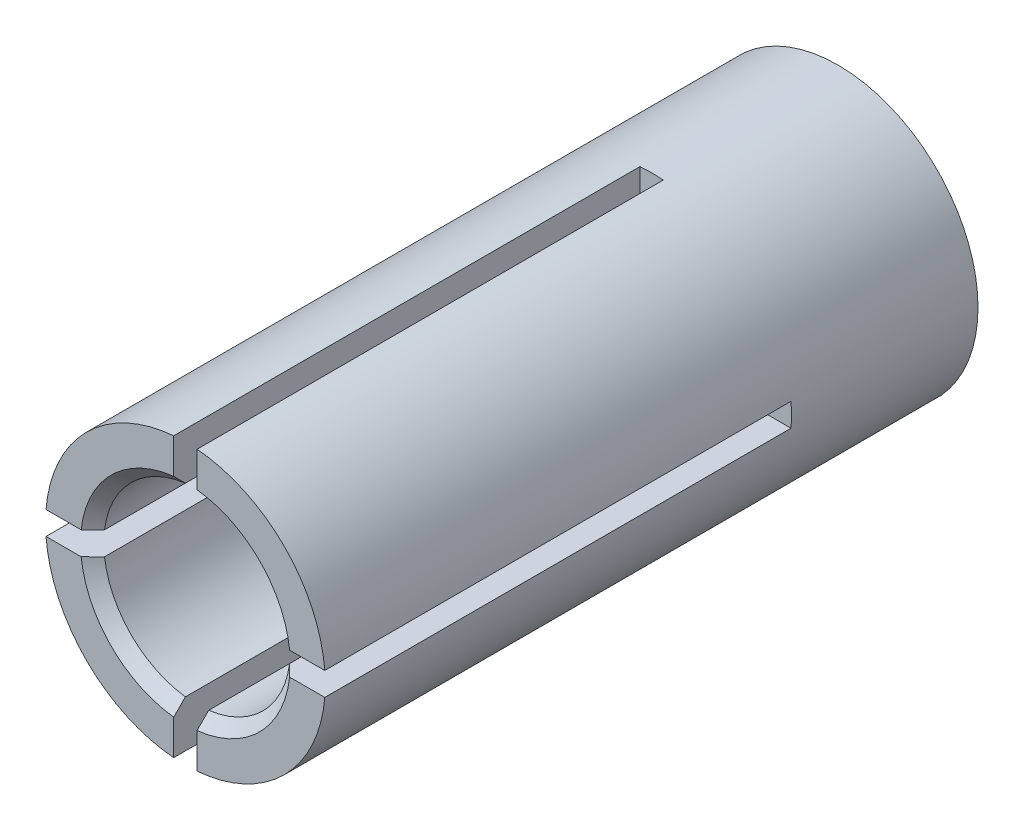
ISO-10303-21;
HEADER;
FILE_DESCRIPTION(('STEP AP214'),'2;1');
FILE_NAME('part.step','',(''),(''),'','','');
FILE_SCHEMA(('AUTOMOTIVE_DESIGN { 1 0 10303 214 1 1 1 1 }'));
ENDSEC;
DATA;
#1=APPLICATION_CONTEXT('core data for automotive mechanical design processes');
#2=APPLICATION_PROTOCOL_DEFINITION('international standard','automotive_design',2000,#1);
#3=PRODUCT_CONTEXT('',#1,'mechanical');
#4=PRODUCT('Part','Part','',(#3));
#5=PRODUCT_RELATED_PRODUCT_CATEGORY('part','',(#4));
#6=PRODUCT_DEFINITION_FORMATION('','',#4);
#7=PRODUCT_DEFINITION_CONTEXT('part definition',#1,'design');
#8=PRODUCT_DEFINITION('design','',#6,#7);
#9=PRODUCT_DEFINITION_SHAPE('','',#8);
#10=(LENGTH_UNIT() NAMED_UNIT(*) SI_UNIT(.MILLI.,.METRE.));
#11=(NAMED_UNIT(*) PLANE_ANGLE_UNIT() SI_UNIT($,.RADIAN.));
#12=(NAMED_UNIT(*) SI_UNIT($,.STERADIAN.) SOLID_ANGLE_UNIT());
#13=UNCERTAINTY_MEASURE_WITH_UNIT(LENGTH_MEASURE(1.E-05),#10,'distance_accuracy_value','');
#14=(GEOMETRIC_REPRESENTATION_CONTEXT(3) GLOBAL_UNCERTAINTY_ASSIGNED_CONTEXT((#13)) GLOBAL_UNIT_ASSIGNED_CONTEXT((#10,
#11,#12)) REPRESENTATION_CONTEXT('',''));
#15=CARTESIAN_POINT('',(0.,0.,0.));
#16=DIRECTION('',(0.,0.,1.));
#17=DIRECTION('',(1.,0.,0.));
#18=AXIS2_PLACEMENT_3D('',#15,#16,#17);
#19=CARTESIAN_POINT('',(0.,0.,14.));
#20=DIRECTION('',(0.,0.,1.));
#21=DIRECTION('',(1.,0.,0.));
#22=AXIS2_PLACEMENT_3D('',#19,#20,#21);
#23=PLANE('',#22);
#24=DIRECTION('',(1.,0.,0.));
#25=VECTOR('',#24,1.);
#26=CARTESIAN_POINT('',(2.98956518577535,-0.25,14.));
#27=LINE('',#26,#25);
#28=CARTESIAN_POINT('',(2.23606797749979,-0.25,14.));
#29=VERTEX_POINT('',#28);
#30=CARTESIAN_POINT('',(2.98956518577535,-0.25,14.));
#31=VERTEX_POINT('',#30);
#32=EDGE_CURVE('E190',#29,#31,#27,.T.);
#33=ORIENTED_EDGE('',*,*,#32,.F.);
#34=CARTESIAN_POINT('',(0.,0.,14.));
#35=DIRECTION('',(0.,0.,1.));
#36=DIRECTION('',(1.,0.,0.));
#37=AXIS2_PLACEMENT_3D('',#34,#35,#36);
#38=CIRCLE('',#37,2.25);
#39=CARTESIAN_POINT('',(0.25,-2.23606797749979,14.));
#40=VERTEX_POINT('',#39);
#41=EDGE_CURVE('E236',#29,#40,#38,.F.);
#42=ORIENTED_EDGE('',*,*,#41,.T.);
#43=DIRECTION('',(0.,1.,0.));
#44=VECTOR('',#43,1.);
#45=CARTESIAN_POINT('',(0.25,-0.25,14.));
#46=LINE('',#45,#44);
#47=CARTESIAN_POINT('',(0.250000000000002,-2.98956518577535,14.));
#48=VERTEX_POINT('',#47);
#49=EDGE_CURVE('E288',#48,#40,#46,.T.);
#50=ORIENTED_EDGE('',*,*,#49,.F.);
#51=CARTESIAN_POINT('',(0.,0.,14.));
#52=DIRECTION('',(0.,0.,1.));
#53=DIRECTION('',(1.,0.,0.));
#54=AXIS2_PLACEMENT_3D('',#51,#52,#53);
#55=CIRCLE('',#54,3.);
#56=EDGE_CURVE('E228',#48,#31,#55,.T.);
#57=ORIENTED_EDGE('',*,*,#56,.T.);
#58=EDGE_LOOP('',(#33,#42,#50,#57));
#59=FACE_BOUND('',#58,.T.);
#60=ADVANCED_FACE('F31',(#59),#23,.T.);
#61=DIRECTION('',(0.,-1.,0.));
#62=VECTOR('',#61,1.);
#63=CARTESIAN_POINT('',(-0.25,-0.25,14.));
#64=LINE('',#63,#62);
#65=CARTESIAN_POINT('',(-0.25,-2.23606797749979,14.));
#66=VERTEX_POINT('',#65);
#67=CARTESIAN_POINT('',(-0.25,-2.98956518577535,14.));
#68=VERTEX_POINT('',#67);
#69=EDGE_CURVE('E395',#66,#68,#64,.T.);
#70=ORIENTED_EDGE('',*,*,#69,.F.);
#71=CARTESIAN_POINT('',(-2.23606797749979,-0.25,14.));
#72=VERTEX_POINT('',#71);
#73=EDGE_CURVE('E240',#66,#72,#38,.F.);
#74=ORIENTED_EDGE('',*,*,#73,.T.);
#75=DIRECTION('',(1.,0.,0.));
#76=VECTOR('',#75,1.);
#77=CARTESIAN_POINT('',(-2.98956518577535,-0.25,14.));
#78=LINE('',#77,#76);
#79=CARTESIAN_POINT('',(-2.98956518577535,-0.249999999999999,14.));
#80=VERTEX_POINT('',#79);
#81=EDGE_CURVE('E393',#80,#72,#78,.T.);
#82=ORIENTED_EDGE('',*,*,#81,.F.);
#83=EDGE_CURVE('E435',#80,#68,#55,.T.);
#84=ORIENTED_EDGE('',*,*,#83,.T.);
#85=EDGE_LOOP('',(#70,#74,#82,#84));
#86=FACE_BOUND('',#85,.T.);
#87=ADVANCED_FACE('F276',(#86),#23,.T.);
#88=DIRECTION('',(-1.,0.,0.));
#89=VECTOR('',#88,1.);
#90=CARTESIAN_POINT('',(-2.98956518577535,0.249999999999998,14.));
#91=LINE('',#90,#89);
#92=CARTESIAN_POINT('',(-2.23606797749979,0.249999999999999,14.));
#93=VERTEX_POINT('',#92);
#94=CARTESIAN_POINT('',(-2.98956518577535,0.249999999999998,14.));
#95=VERTEX_POINT('',#94);
#96=EDGE_CURVE('E413',#93,#95,#91,.T.);
#97=ORIENTED_EDGE('',*,*,#96,.F.);
#98=CARTESIAN_POINT('',(-0.25,2.23606797749979,14.));
#99=VERTEX_POINT('',#98);
#100=EDGE_CURVE('E382',#93,#99,#38,.F.);
#101=ORIENTED_EDGE('',*,*,#100,.T.);
#102=DIRECTION('',(0.,-1.,0.));
#103=VECTOR('',#102,1.);
#104=CARTESIAN_POINT('',(-0.25,0.25,14.));
#105=LINE('',#104,#103);
#106=CARTESIAN_POINT('',(-0.25,2.98956518577535,14.));
#107=VERTEX_POINT('',#106);
#108=EDGE_CURVE('E416',#107,#99,#105,.T.);
#109=ORIENTED_EDGE('',*,*,#108,.F.);
#110=EDGE_CURVE('E227',#107,#95,#55,.T.);
#111=ORIENTED_EDGE('',*,*,#110,.T.);
#112=EDGE_LOOP('',(#97,#101,#109,#111));
#113=FACE_BOUND('',#112,.T.);
#114=ADVANCED_FACE('F269',(#113),#23,.T.);
#115=CARTESIAN_POINT('',(0.,0.,13.75));
#116=DIRECTION('',(0.,0.,1.));
#117=DIRECTION('',(1.,0.,0.));
#118=AXIS2_PLACEMENT_3D('',#115,#116,#117);
#119=CONICAL_SURFACE('',#118,2.,0.785398163397455);
#120=CARTESIAN_POINT('',(0.302741084224424,-0.25,12.1426221645264));
#121=CARTESIAN_POINT('',(0.317960453729847,-0.25,12.1543679730482));
#122=CARTESIAN_POINT('',(0.333014531848367,-0.25,12.1663229463904));
#123=CARTESIAN_POINT('',(0.36285792672978,-0.25,12.190554220147));
#124=CARTESIAN_POINT('',(0.377647290102898,-0.25,12.2028304630369));
#125=CARTESIAN_POINT('',(0.421711584192529,-0.25,12.2399907180696));
#126=CARTESIAN_POINT('',(0.450696505860515,-0.25,12.2652171671053));
#127=CARTESIAN_POINT('',(0.508176291730957,-0.25,12.3161879557759));
#128=CARTESIAN_POINT('',(0.536671402315201,-0.25,12.3419320200088));
#129=CARTESIAN_POINT('',(0.593351685196753,-0.25,12.3937670443241));
#130=CARTESIAN_POINT('',(0.621536809723744,-0.25,12.4198580565411));
#131=CARTESIAN_POINT('',(0.70945296388415,-0.25,12.5018997394878));
#132=CARTESIAN_POINT('',(0.768811177280418,-0.25,12.5582489591398));
#133=CARTESIAN_POINT('',(0.887045822918402,-0.25,12.6714511318724));
#134=CARTESIAN_POINT('',(0.945922240026668,-0.25,12.72830410066));
#135=CARTESIAN_POINT('',(1.12213731279967,-0.25,12.8992872007103));
#136=CARTESIAN_POINT('',(1.23906296186066,-0.25,13.013842641041));
#137=CARTESIAN_POINT('',(1.47257646545155,-0.25,13.2435090676362));
#138=CARTESIAN_POINT('',(1.58916391117353,-0.25,13.3586204674635));
#139=CARTESIAN_POINT('',(1.82209400881993,-0.25,13.5890861029974));
#140=CARTESIAN_POINT('',(1.9384366657381,-0.25,13.7044403336521));
#141=CARTESIAN_POINT('',(2.19822193413989,-0.25,13.9623251721432));
#142=CARTESIAN_POINT('',(2.34162858752974,-0.25,14.104891962737));
#143=CARTESIAN_POINT('',(2.62832290392371,-0.25,14.3901473591601));
#144=CARTESIAN_POINT('',(2.77161056599507,-0.25,14.5328359659267));
#145=CARTESIAN_POINT('',(3.05792402957366,-0.25,14.8181018736583));
#146=CARTESIAN_POINT('',(3.20094992869957,-0.25,14.9606790766729));
#147=CARTESIAN_POINT('',(3.48694883303794,-0.25,15.2458841152313));
#148=CARTESIAN_POINT('',(3.6299218386862,-0.25,15.3885119503382));
#149=CARTESIAN_POINT('',(3.77288046266891,-0.25,15.5311541869631));
#150=B_SPLINE_CURVE_WITH_KNOTS('',3,(#120,#121,#122,#123,#124,#125,#126,#127,#128,#129,#130,
#131,#132,#133,#134,#135,#136,#137,#138,#139,#140,#141,#142,#143,#144,#145,#146,#147,#148,#149),
.UNSPECIFIED.,.F.,.F.,(4,2,2,2,2,2,2,2,2,2,2,2,2,2,4),(0.,0.057668137817235,0.115326019670359,
0.23058906804333,0.345792332639199,0.461013108618342,0.706541151172433,0.952076876502175,
1.44314347376522,1.93466102702139,2.42616845403975,3.03281229507879,3.63946084754578,
4.24531725391537,4.85116855206024),.UNSPECIFIED.);
#151=CARTESIAN_POINT('',(1.98431348329844,-0.25,13.75));
#152=VERTEX_POINT('',#151);
#153=EDGE_CURVE('E295',#152,#29,#150,.T.);
#154=ORIENTED_EDGE('',*,*,#153,.F.);
#155=CARTESIAN_POINT('',(0.,0.,13.75));
#156=DIRECTION('',(0.,0.,1.));
#157=DIRECTION('',(1.,0.,0.));
#158=AXIS2_PLACEMENT_3D('',#155,#156,#157);
#159=CIRCLE('',#158,2.);
#160=CARTESIAN_POINT('',(0.25,-1.98431348329844,13.75));
#161=VERTEX_POINT('',#160);
#162=EDGE_CURVE('E226',#161,#152,#159,.T.);
#163=ORIENTED_EDGE('',*,*,#162,.F.);
#164=CARTESIAN_POINT('',(0.25,-3.77288046266891,15.5311541869631));
#165=CARTESIAN_POINT('',(0.25,-3.62981802243947,15.3884085007871));
#166=CARTESIAN_POINT('',(0.25,-3.48674127796846,15.245677131242));
#167=CARTESIAN_POINT('',(0.25,-3.20054113992748,14.9602714322271));
#168=CARTESIAN_POINT('',(0.25,-3.05741774821332,14.8175971008963));
#169=CARTESIAN_POINT('',(0.25,-2.77111016330189,14.5323377376306));
#170=CARTESIAN_POINT('',(0.25,-2.62792597750641,14.3897526982675));
#171=CARTESIAN_POINT('',(0.25,-2.34143336691177,14.1046974507362));
#172=CARTESIAN_POINT('',(0.25,-2.19812493795967,13.9622272467398));
#173=CARTESIAN_POINT('',(0.25,-1.98298880509478,13.7486673764058));
#174=CARTESIAN_POINT('',(0.25,-1.91124050811756,13.6774977298582));
#175=CARTESIAN_POINT('',(0.25,-1.76767011833127,13.5352348752943));
#176=CARTESIAN_POINT('',(0.25,-1.69584802655194,13.464141666239));
#177=CARTESIAN_POINT('',(0.25,-1.55210436650431,13.3220711612731));
#178=CARTESIAN_POINT('',(0.25,-1.48018280965929,13.2510938538114));
#179=CARTESIAN_POINT('',(0.25,-1.33617309257203,13.1093013228982));
#180=CARTESIAN_POINT('',(0.25,-1.2640849242968,13.0384861076038));
#181=CARTESIAN_POINT('',(0.25,-1.11962163137609,12.8970953300996));
#182=CARTESIAN_POINT('',(0.25,-1.04724641128778,12.8265198651804));
#183=CARTESIAN_POINT('',(0.25,-0.938335808618407,12.7210277003167));
#184=CARTESIAN_POINT('',(0.25,-0.90197738080137,12.6859284166719));
#185=CARTESIAN_POINT('',(0.25,-0.829090459358274,12.6159028370612));
#186=CARTESIAN_POINT('',(0.25,-0.792561957067124,12.5809765501007));
#187=CARTESIAN_POINT('',(0.25,-0.719238707395647,12.5113617459312));
#188=CARTESIAN_POINT('',(0.25,-0.682443818330706,12.4766733778196));
#189=CARTESIAN_POINT('',(0.25,-0.608484016046663,12.4077018126905));
#190=CARTESIAN_POINT('',(0.25,-0.57131915658067,12.3734185583522));
#191=CARTESIAN_POINT('',(0.25,-0.51508999379516,12.3224993377492));
#192=CARTESIAN_POINT('',(0.25,-0.496260183651158,12.3056049183895));
#193=CARTESIAN_POINT('',(0.25,-0.458389334451682,12.2720572281331));
#194=CARTESIAN_POINT('',(0.25,-0.439348311762073,12.2554039387796));
#195=CARTESIAN_POINT('',(0.25,-0.400970972219268,12.2224183848648));
#196=CARTESIAN_POINT('',(0.25,-0.381634510005532,12.206086288006));
#197=CARTESIAN_POINT('',(0.25,-0.342537743825695,12.1739281736697));
#198=CARTESIAN_POINT('',(0.25,-0.32277732694518,12.1581022938832));
#199=CARTESIAN_POINT('',(0.25,-0.302741084224424,12.1426221645264));
#200=B_SPLINE_CURVE_WITH_KNOTS('',3,(#164,#165,#166,#167,#168,#169,#170,#171,#172,#173,#174,
#175,#176,#177,#178,#179,#180,#181,#182,#183,#184,#185,#186,#187,#188,#189,#190,#191,#192,#193,
#194,#195,#196,#197,#198,#199),.UNSPECIFIED.,.F.,.F.,(4,2,2,2,2,2,2,2,2,2,2,2,2,2,2,2,2,4),(0.,
0.606290986171906,1.21256024144211,1.81876961421285,2.42500009807164,2.72817728399238,
3.03135029532569,3.33449098070736,3.63764660000146,3.94091326932693,4.09252113778145,
4.24413681689769,4.39584012888943,4.5475217125328,4.62341380562543,4.69930005871457,
4.77522493487536,4.85117028995729),.UNSPECIFIED.);
#201=EDGE_CURVE('E297',#40,#161,#200,.T.);
#202=ORIENTED_EDGE('',*,*,#201,.F.);
#203=ORIENTED_EDGE('',*,*,#41,.F.);
#204=EDGE_LOOP('',(#154,#163,#202,#203));
#205=FACE_BOUND('',#204,.T.);
#206=ADVANCED_FACE('F293',(#205),#119,.F.);
#207=CARTESIAN_POINT('',(-0.25,-0.302741084224424,12.1426221645264));
#208=CARTESIAN_POINT('',(-0.25,-0.317960453729848,12.1543679730482));
#209=CARTESIAN_POINT('',(-0.25,-0.333014531848367,12.1663229463904));
#210=CARTESIAN_POINT('',(-0.25,-0.362857926729781,12.190554220147));
#211=CARTESIAN_POINT('',(-0.25,-0.377647290102899,12.2028304630369));
#212=CARTESIAN_POINT('',(-0.25,-0.42171158419253,12.2399907180696));
#213=CARTESIAN_POINT('',(-0.25,-0.450696505860516,12.2652171671053));
#214=CARTESIAN_POINT('',(-0.25,-0.508176291730958,12.3161879557759));
#215=CARTESIAN_POINT('',(-0.25,-0.536671402315201,12.3419320200088));
#216=CARTESIAN_POINT('',(-0.25,-0.593351685196753,12.3937670443241));
#217=CARTESIAN_POINT('',(-0.25,-0.621536809723744,12.4198580565411));
#218=CARTESIAN_POINT('',(-0.25,-0.70945296388415,12.5018997394878));
#219=CARTESIAN_POINT('',(-0.25,-0.768811177280418,12.5582489591398));
#220=CARTESIAN_POINT('',(-0.25,-0.887045822918402,12.6714511318724));
#221=CARTESIAN_POINT('',(-0.25,-0.945922240026668,12.72830410066));
#222=CARTESIAN_POINT('',(-0.25,-1.12213731279967,12.8992872007103));
#223=CARTESIAN_POINT('',(-0.25,-1.23906296186066,13.013842641041));
#224=CARTESIAN_POINT('',(-0.25,-1.47257646545154,13.2435090676362));
#225=CARTESIAN_POINT('',(-0.25,-1.58916391117353,13.3586204674635));
#226=CARTESIAN_POINT('',(-0.25,-1.82209400881993,13.5890861029974));
#227=CARTESIAN_POINT('',(-0.25,-1.9384366657381,13.7044403336521));
#228=CARTESIAN_POINT('',(-0.25,-2.19822193413989,13.9623251721432));
#229=CARTESIAN_POINT('',(-0.25,-2.34162858752974,14.104891962737));
#230=CARTESIAN_POINT('',(-0.25,-2.62832290392371,14.3901473591601));
#231=CARTESIAN_POINT('',(-0.25,-2.77161056599507,14.5328359659267));
#232=CARTESIAN_POINT('',(-0.25,-3.05792402957366,14.8181018736583));
#233=CARTESIAN_POINT('',(-0.25,-3.20094992869957,14.9606790766729));
#234=CARTESIAN_POINT('',(-0.25,-3.48694883303794,15.2458841152313));
#235=CARTESIAN_POINT('',(-0.25,-3.6299218386862,15.3885119503382));
#236=CARTESIAN_POINT('',(-0.25,-3.77288046266891,15.5311541869631));
#237=B_SPLINE_CURVE_WITH_KNOTS('',3,(#207,#208,#209,#210,#211,#212,#213,#214,#215,#216,#217,
#218,#219,#220,#221,#222,#223,#224,#225,#226,#227,#228,#229,#230,#231,#232,#233,#234,#235,#236),
.UNSPECIFIED.,.F.,.F.,(4,2,2,2,2,2,2,2,2,2,2,2,2,2,4),(0.,0.0576681378172352,0.115326019670361,
0.23058906804333,0.345792332639199,0.461013108618341,0.706541151172433,0.952076876502175,
1.44314347376522,1.93466102702138,2.42616845403975,3.03281229507879,3.63946084754578,
4.24531725391537,4.85116855206024),.UNSPECIFIED.);
#238=CARTESIAN_POINT('',(-0.25,-1.98431348329844,13.75));
#239=VERTEX_POINT('',#238);
#240=EDGE_CURVE('E300',#239,#66,#237,.T.);
#241=ORIENTED_EDGE('',*,*,#240,.F.);
#242=CARTESIAN_POINT('',(-1.98431348329844,-0.25,13.75));
#243=VERTEX_POINT('',#242);
#244=EDGE_CURVE('E401',#243,#239,#159,.T.);
#245=ORIENTED_EDGE('',*,*,#244,.F.);
#246=CARTESIAN_POINT('',(-3.77288046266891,-0.25,15.5311541869631));
#247=CARTESIAN_POINT('',(-3.62981802243947,-0.25,15.3884085007871));
#248=CARTESIAN_POINT('',(-3.48674127796846,-0.25,15.245677131242));
#249=CARTESIAN_POINT('',(-3.20054113992748,-0.25,14.9602714322271));
#250=CARTESIAN_POINT('',(-3.05741774821332,-0.25,14.8175971008962));
#251=CARTESIAN_POINT('',(-2.77111016330189,-0.25,14.5323377376306));
#252=CARTESIAN_POINT('',(-2.6279259775064,-0.25,14.3897526982675));
#253=CARTESIAN_POINT('',(-2.34143336691176,-0.25,14.1046974507362));
#254=CARTESIAN_POINT('',(-2.19812493795967,-0.25,13.9622272467398));
#255=CARTESIAN_POINT('',(-1.98298880509478,-0.25,13.7486673764058));
#256=CARTESIAN_POINT('',(-1.91124050811756,-0.25,13.6774977298582));
#257=CARTESIAN_POINT('',(-1.76767011833127,-0.25,13.5352348752943));
#258=CARTESIAN_POINT('',(-1.69584802655194,-0.25,13.464141666239));
#259=CARTESIAN_POINT('',(-1.55210436650431,-0.25,13.3220711612731));
#260=CARTESIAN_POINT('',(-1.48018280965929,-0.25,13.2510938538114));
#261=CARTESIAN_POINT('',(-1.33617309257203,-0.25,13.1093013228982));
#262=CARTESIAN_POINT('',(-1.2640849242968,-0.25,13.0384861076038));
#263=CARTESIAN_POINT('',(-1.11962163137609,-0.25,12.8970953300996));
#264=CARTESIAN_POINT('',(-1.04724641128778,-0.25,12.8265198651804));
#265=CARTESIAN_POINT('',(-0.938335808618407,-0.25,12.7210277003167));
#266=CARTESIAN_POINT('',(-0.901977380801369,-0.25,12.6859284166719));
#267=CARTESIAN_POINT('',(-0.829090459358274,-0.25,12.6159028370612));
#268=CARTESIAN_POINT('',(-0.792561957067124,-0.25,12.5809765501007));
#269=CARTESIAN_POINT('',(-0.719238707395648,-0.25,12.5113617459312));
#270=CARTESIAN_POINT('',(-0.682443818330707,-0.25,12.4766733778196));
#271=CARTESIAN_POINT('',(-0.608484016046665,-0.25,12.4077018126905));
#272=CARTESIAN_POINT('',(-0.571319156580671,-0.25,12.3734185583522));
#273=CARTESIAN_POINT('',(-0.515089993795162,-0.25,12.3224993377492));
#274=CARTESIAN_POINT('',(-0.496260183651158,-0.25,12.3056049183895));
#275=CARTESIAN_POINT('',(-0.458389334451683,-0.25,12.2720572281331));
#276=CARTESIAN_POINT('',(-0.439348311762074,-0.25,12.2554039387796));
#277=CARTESIAN_POINT('',(-0.40097097221927,-0.25,12.2224183848648));
#278=CARTESIAN_POINT('',(-0.381634510005534,-0.25,12.2060862880061));
#279=CARTESIAN_POINT('',(-0.342537743825697,-0.25,12.1739281736697));
#280=CARTESIAN_POINT('',(-0.322777326945181,-0.25,12.1581022938832));
#281=CARTESIAN_POINT('',(-0.302741084224424,-0.25,12.1426221645264));
#282=B_SPLINE_CURVE_WITH_KNOTS('',3,(#246,#247,#248,#249,#250,#251,#252,#253,#254,#255,#256,
#257,#258,#259,#260,#261,#262,#263,#264,#265,#266,#267,#268,#269,#270,#271,#272,#273,#274,#275,
#276,#277,#278,#279,#280,#281),.UNSPECIFIED.,.F.,.F.,(4,2,2,2,2,2,2,2,2,2,2,2,2,2,2,2,2,4),(0.,
0.606290986171907,1.21256024144211,1.81876961421285,2.42500009807164,2.72817728399238,
3.03135029532568,3.33449098070736,3.63764660000146,3.94091326932692,4.09252113778145,
4.24413681689769,4.39584012888943,4.54752171253279,4.62341380562543,4.69930005871457,
4.77522493487535,4.85117028995728),.UNSPECIFIED.);
#283=EDGE_CURVE('E302',#72,#243,#282,.T.);
#284=ORIENTED_EDGE('',*,*,#283,.F.);
#285=ORIENTED_EDGE('',*,*,#73,.F.);
#286=EDGE_LOOP('',(#241,#245,#284,#285));
#287=FACE_BOUND('',#286,.T.);
#288=ADVANCED_FACE('F398',(#287),#119,.F.);
#289=CARTESIAN_POINT('',(-0.302741084224424,0.25,12.1426221645264));
#290=CARTESIAN_POINT('',(-0.317960453729848,0.25,12.1543679730482));
#291=CARTESIAN_POINT('',(-0.333014531848368,0.25,12.1663229463904));
#292=CARTESIAN_POINT('',(-0.362857926729781,0.25,12.190554220147));
#293=CARTESIAN_POINT('',(-0.3776472901029,0.25,12.2028304630369));
#294=CARTESIAN_POINT('',(-0.42171158419253,0.25,12.2399907180696));
#295=CARTESIAN_POINT('',(-0.450696505860517,0.25,12.2652171671053));
#296=CARTESIAN_POINT('',(-0.508176291730959,0.25,12.3161879557759));
#297=CARTESIAN_POINT('',(-0.536671402315202,0.25,12.3419320200088));
#298=CARTESIAN_POINT('',(-0.593351685196754,0.25,12.3937670443241));
#299=CARTESIAN_POINT('',(-0.621536809723745,0.25,12.4198580565411));
#300=CARTESIAN_POINT('',(-0.709452963884151,0.25,12.5018997394878));
#301=CARTESIAN_POINT('',(-0.768811177280419,0.25,12.5582489591398));
#302=CARTESIAN_POINT('',(-0.887045822918403,0.249999999999999,12.6714511318724));
#303=CARTESIAN_POINT('',(-0.945922240026669,0.249999999999999,12.72830410066));
#304=CARTESIAN_POINT('',(-1.12213731279967,0.249999999999999,12.8992872007103));
#305=CARTESIAN_POINT('',(-1.23906296186066,0.249999999999999,13.013842641041));
#306=CARTESIAN_POINT('',(-1.47257646545154,0.249999999999999,13.2435090676362));
#307=CARTESIAN_POINT('',(-1.58916391117353,0.249999999999999,13.3586204674635));
#308=CARTESIAN_POINT('',(-1.82209400881993,0.249999999999999,13.5890861029974));
#309=CARTESIAN_POINT('',(-1.9384366657381,0.249999999999999,13.7044403336521));
#310=CARTESIAN_POINT('',(-2.19822193413988,0.249999999999999,13.9623251721432));
#311=CARTESIAN_POINT('',(-2.34162858752973,0.249999999999999,14.104891962737));
#312=CARTESIAN_POINT('',(-2.62832290392371,0.249999999999998,14.3901473591601));
#313=CARTESIAN_POINT('',(-2.77161056599507,0.249999999999998,14.5328359659267));
#314=CARTESIAN_POINT('',(-3.05792402957366,0.249999999999998,14.8181018736583));
#315=CARTESIAN_POINT('',(-3.20094992869957,0.249999999999998,14.9606790766729));
#316=CARTESIAN_POINT('',(-3.48694883303793,0.249999999999998,15.2458841152313));
#317=CARTESIAN_POINT('',(-3.6299218386862,0.249999999999998,15.3885119503382));
#318=CARTESIAN_POINT('',(-3.77288046266891,0.249999999999998,15.5311541869631));
#319=B_SPLINE_CURVE_WITH_KNOTS('',3,(#289,#290,#291,#292,#293,#294,#295,#296,#297,#298,#299,
#300,#301,#302,#303,#304,#305,#306,#307,#308,#309,#310,#311,#312,#313,#314,#315,#316,#317,#318),
.UNSPECIFIED.,.F.,.F.,(4,2,2,2,2,2,2,2,2,2,2,2,2,2,4),(0.,0.0576681378172349,0.115326019670361,
0.230589068043331,0.345792332639199,0.461013108618343,0.706541151172433,0.952076876502175,
1.44314347376522,1.93466102702138,2.42616845403975,3.03281229507879,3.63946084754578,
4.24531725391537,4.85116855206023),.UNSPECIFIED.);
#320=CARTESIAN_POINT('',(-1.98431348329844,0.249999999999999,13.75));
#321=VERTEX_POINT('',#320);
#322=EDGE_CURVE('E339',#321,#93,#319,.T.);
#323=ORIENTED_EDGE('',*,*,#322,.F.);
#324=CARTESIAN_POINT('',(-0.25,1.98431348329844,13.75));
#325=VERTEX_POINT('',#324);
#326=EDGE_CURVE('E235',#325,#321,#159,.T.);
#327=ORIENTED_EDGE('',*,*,#326,.F.);
#328=CARTESIAN_POINT('',(-0.25,3.77288046266891,15.5311541869631));
#329=CARTESIAN_POINT('',(-0.25,3.62981802243947,15.3884085007871));
#330=CARTESIAN_POINT('',(-0.25,3.48674127796846,15.245677131242));
#331=CARTESIAN_POINT('',(-0.25,3.20054113992748,14.9602714322271));
#332=CARTESIAN_POINT('',(-0.25,3.05741774821332,14.8175971008962));
#333=CARTESIAN_POINT('',(-0.25,2.77111016330189,14.5323377376306));
#334=CARTESIAN_POINT('',(-0.25,2.6279259775064,14.3897526982675));
#335=CARTESIAN_POINT('',(-0.25,2.34143336691176,14.1046974507362));
#336=CARTESIAN_POINT('',(-0.25,2.19812493795967,13.9622272467398));
#337=CARTESIAN_POINT('',(-0.25,1.98298880509478,13.7486673764058));
#338=CARTESIAN_POINT('',(-0.25,1.91124050811756,13.6774977298582));
#339=CARTESIAN_POINT('',(-0.25,1.76767011833127,13.5352348752943));
#340=CARTESIAN_POINT('',(-0.25,1.69584802655194,13.464141666239));
#341=CARTESIAN_POINT('',(-0.25,1.55210436650431,13.3220711612731));
#342=CARTESIAN_POINT('',(-0.25,1.48018280965929,13.2510938538114));
#343=CARTESIAN_POINT('',(-0.25,1.33617309257203,13.1093013228982));
#344=CARTESIAN_POINT('',(-0.25,1.2640849242968,13.0384861076038));
#345=CARTESIAN_POINT('',(-0.25,1.11962163137609,12.8970953300996));
#346=CARTESIAN_POINT('',(-0.25,1.04724641128778,12.8265198651804));
#347=CARTESIAN_POINT('',(-0.25,0.938335808618407,12.7210277003167));
#348=CARTESIAN_POINT('',(-0.25,0.901977380801369,12.6859284166719));
#349=CARTESIAN_POINT('',(-0.25,0.829090459358274,12.6159028370612));
#350=CARTESIAN_POINT('',(-0.25,0.792561957067124,12.5809765501007));
#351=CARTESIAN_POINT('',(-0.25,0.719238707395648,12.5113617459312));
#352=CARTESIAN_POINT('',(-0.25,0.682443818330707,12.4766733778196));
#353=CARTESIAN_POINT('',(-0.25,0.608484016046665,12.4077018126905));
#354=CARTESIAN_POINT('',(-0.25,0.571319156580672,12.3734185583522));
#355=CARTESIAN_POINT('',(-0.25,0.515089993795162,12.3224993377492));
#356=CARTESIAN_POINT('',(-0.25,0.496260183651158,12.3056049183895));
#357=CARTESIAN_POINT('',(-0.25,0.458389334451682,12.2720572281331));
#358=CARTESIAN_POINT('',(-0.25,0.439348311762074,12.2554039387796));
#359=CARTESIAN_POINT('',(-0.25,0.40097097221927,12.2224183848648));
#360=CARTESIAN_POINT('',(-0.25,0.381634510005534,12.2060862880061));
#361=CARTESIAN_POINT('',(-0.25,0.342537743825697,12.1739281736697));
#362=CARTESIAN_POINT('',(-0.25,0.322777326945181,12.1581022938832));
#363=CARTESIAN_POINT('',(-0.25,0.302741084224424,12.1426221645264));
#364=B_SPLINE_CURVE_WITH_KNOTS('',3,(#328,#329,#330,#331,#332,#333,#334,#335,#336,#337,#338,
#339,#340,#341,#342,#343,#344,#345,#346,#347,#348,#349,#350,#351,#352,#353,#354,#355,#356,#357,
#358,#359,#360,#361,#362,#363),.UNSPECIFIED.,.F.,.F.,(4,2,2,2,2,2,2,2,2,2,2,2,2,2,2,2,2,4),(0.,
0.606290986171907,1.21256024144211,1.81876961421285,2.42500009807164,2.72817728399238,
3.03135029532568,3.33449098070736,3.63764660000146,3.94091326932692,4.09252113778145,
4.24413681689769,4.39584012888943,4.54752171253279,4.62341380562542,4.69930005871457,
4.77522493487536,4.85117028995728),.UNSPECIFIED.);
#365=EDGE_CURVE('E343',#99,#325,#364,.T.);
#366=ORIENTED_EDGE('',*,*,#365,.F.);
#367=ORIENTED_EDGE('',*,*,#100,.F.);
#368=EDGE_LOOP('',(#323,#327,#366,#367));
#369=FACE_BOUND('',#368,.T.);
#370=ADVANCED_FACE('F267',(#369),#119,.F.);
#371=DIRECTION('',(0.,1.,0.));
#372=VECTOR('',#371,1.);
#373=CARTESIAN_POINT('',(0.25,2.98956518577535,14.));
#374=LINE('',#373,#372);
#375=CARTESIAN_POINT('',(0.25,2.23606797749979,14.));
#376=VERTEX_POINT('',#375);
#377=CARTESIAN_POINT('',(0.25,2.98956518577535,14.));
#378=VERTEX_POINT('',#377);
#379=EDGE_CURVE('E419',#376,#378,#374,.T.);
#380=ORIENTED_EDGE('',*,*,#379,.F.);
#381=CARTESIAN_POINT('',(2.23606797749979,0.25,14.));
#382=VERTEX_POINT('',#381);
#383=EDGE_CURVE('E234',#376,#382,#38,.F.);
#384=ORIENTED_EDGE('',*,*,#383,.T.);
#385=DIRECTION('',(-1.,0.,0.));
#386=VECTOR('',#385,1.);
#387=CARTESIAN_POINT('',(0.25,0.25,14.));
#388=LINE('',#387,#386);
#389=CARTESIAN_POINT('',(2.98956518577535,0.25,14.));
#390=VERTEX_POINT('',#389);
#391=EDGE_CURVE('E451',#390,#382,#388,.T.);
#392=ORIENTED_EDGE('',*,*,#391,.F.);
#393=EDGE_CURVE('E198',#390,#378,#55,.T.);
#394=ORIENTED_EDGE('',*,*,#393,.T.);
#395=EDGE_LOOP('',(#380,#384,#392,#394));
#396=FACE_BOUND('',#395,.T.);
#397=ADVANCED_FACE('F263',(#396),#23,.T.);
#398=CARTESIAN_POINT('',(0.,0.,0.));
#399=DIRECTION('',(0.,0.,1.));
#400=DIRECTION('',(1.,0.,0.));
#401=AXIS2_PLACEMENT_3D('',#398,#399,#400);
#402=PLANE('',#401);
#403=CARTESIAN_POINT('',(0.,0.,0.));
#404=DIRECTION('',(0.,0.,1.));
#405=DIRECTION('',(1.,0.,0.));
#406=AXIS2_PLACEMENT_3D('',#403,#404,#405);
#407=CIRCLE('',#406,3.);
#408=CARTESIAN_POINT('',(3.,0.,0.));
#409=VERTEX_POINT('',#408);
#410=EDGE_CURVE('E224',#409,#409,#407,.T.);
#411=ORIENTED_EDGE('',*,*,#410,.F.);
#412=EDGE_LOOP('',(#411));
#413=FACE_BOUND('',#412,.T.);
#414=CARTESIAN_POINT('',(0.,0.,0.));
#415=DIRECTION('',(0.,0.,1.));
#416=DIRECTION('',(1.,0.,0.));
#417=AXIS2_PLACEMENT_3D('',#414,#415,#416);
#418=CIRCLE('',#417,2.);
#419=CARTESIAN_POINT('',(2.,0.,0.));
#420=VERTEX_POINT('',#419);
#421=EDGE_CURVE('E221',#420,#420,#418,.T.);
#422=ORIENTED_EDGE('',*,*,#421,.T.);
#423=EDGE_LOOP('',(#422));
#424=FACE_BOUND('',#423,.T.);
#425=ADVANCED_FACE('F266',(#413,#424),#402,.F.);
#426=CARTESIAN_POINT('',(0.,0.,14.));
#427=DIRECTION('',(0.,0.,-1.));
#428=DIRECTION('',(-1.,0.,0.));
#429=AXIS2_PLACEMENT_3D('',#426,#427,#428);
#430=CYLINDRICAL_SURFACE('',#429,3.);
#431=ORIENTED_EDGE('',*,*,#110,.F.);
#432=DIRECTION('',(0.,0.,1.));
#433=VECTOR('',#432,1.);
#434=CARTESIAN_POINT('',(-0.25,2.98956518577535,4.));
#435=LINE('',#434,#433);
#436=CARTESIAN_POINT('',(-0.25,2.98956518577535,4.));
#437=VERTEX_POINT('',#436);
#438=EDGE_CURVE('E201',#437,#107,#435,.T.);
#439=ORIENTED_EDGE('',*,*,#438,.F.);
#440=CARTESIAN_POINT('',(0.,0.,4.));
#441=DIRECTION('',(0.,0.,1.));
#442=DIRECTION('',(-1.,0.,0.));
#443=AXIS2_PLACEMENT_3D('',#440,#441,#442);
#444=CIRCLE('',#443,3.);
#445=CARTESIAN_POINT('',(0.25,2.98956518577535,4.));
#446=VERTEX_POINT('',#445);
#447=EDGE_CURVE('E368',#446,#437,#444,.T.);
#448=ORIENTED_EDGE('',*,*,#447,.F.);
#449=DIRECTION('',(0.,0.,1.));
#450=VECTOR('',#449,1.);
#451=CARTESIAN_POINT('',(0.25,2.98956518577535,4.));
#452=LINE('',#451,#450);
#453=EDGE_CURVE('E199',#446,#378,#452,.T.);
#454=ORIENTED_EDGE('',*,*,#453,.T.);
#455=ORIENTED_EDGE('',*,*,#393,.F.);
#456=DIRECTION('',(0.,0.,1.));
#457=VECTOR('',#456,1.);
#458=CARTESIAN_POINT('',(2.98956518577535,0.25,4.));
#459=LINE('',#458,#457);
#460=CARTESIAN_POINT('',(2.98956518577535,0.25,4.));
#461=VERTEX_POINT('',#460);
#462=EDGE_CURVE('E174',#461,#390,#459,.T.);
#463=ORIENTED_EDGE('',*,*,#462,.F.);
#464=CARTESIAN_POINT('',(0.,0.,4.));
#465=DIRECTION('',(0.,0.,1.));
#466=DIRECTION('',(-1.,0.,0.));
#467=AXIS2_PLACEMENT_3D('',#464,#465,#466);
#468=CIRCLE('',#467,3.);
#469=CARTESIAN_POINT('',(2.98956518577535,-0.25,4.));
#470=VERTEX_POINT('',#469);
#471=EDGE_CURVE('E181',#470,#461,#468,.T.);
#472=ORIENTED_EDGE('',*,*,#471,.F.);
#473=DIRECTION('',(0.,0.,1.));
#474=VECTOR('',#473,1.);
#475=CARTESIAN_POINT('',(2.98956518577535,-0.25,4.));
#476=LINE('',#475,#474);
#477=EDGE_CURVE('E209',#470,#31,#476,.T.);
#478=ORIENTED_EDGE('',*,*,#477,.T.);
#479=ORIENTED_EDGE('',*,*,#56,.F.);
#480=DIRECTION('',(0.,0.,1.));
#481=VECTOR('',#480,1.);
#482=CARTESIAN_POINT('',(0.250000000000002,-2.98956518577535,4.));
#483=LINE('',#482,#481);
#484=CARTESIAN_POINT('',(0.250000000000002,-2.98956518577535,4.));
#485=VERTEX_POINT('',#484);
#486=EDGE_CURVE('E426',#485,#48,#483,.T.);
#487=ORIENTED_EDGE('',*,*,#486,.F.);
#488=CARTESIAN_POINT('',(0.,0.,4.));
#489=DIRECTION('',(0.,0.,1.));
#490=DIRECTION('',(-1.,0.,0.));
#491=AXIS2_PLACEMENT_3D('',#488,#489,#490);
#492=CIRCLE('',#491,3.);
#493=CARTESIAN_POINT('',(-0.25,-2.98956518577535,4.));
#494=VERTEX_POINT('',#493);
#495=EDGE_CURVE('E441',#494,#485,#492,.T.);
#496=ORIENTED_EDGE('',*,*,#495,.F.);
#497=DIRECTION('',(0.,0.,1.));
#498=VECTOR('',#497,1.);
#499=CARTESIAN_POINT('',(-0.25,-2.98956518577535,4.));
#500=LINE('',#499,#498);
#501=EDGE_CURVE('E428',#494,#68,#500,.T.);
#502=ORIENTED_EDGE('',*,*,#501,.T.);
#503=ORIENTED_EDGE('',*,*,#83,.F.);
#504=DIRECTION('',(0.,0.,1.));
#505=VECTOR('',#504,1.);
#506=CARTESIAN_POINT('',(-2.98956518577535,-0.249999999999999,4.));
#507=LINE('',#506,#505);
#508=CARTESIAN_POINT('',(-2.98956518577535,-0.249999999999999,4.));
#509=VERTEX_POINT('',#508);
#510=EDGE_CURVE('E431',#509,#80,#507,.T.);
#511=ORIENTED_EDGE('',*,*,#510,.F.);
#512=CARTESIAN_POINT('',(0.,0.,4.));
#513=DIRECTION('',(0.,0.,1.));
#514=DIRECTION('',(-1.,0.,0.));
#515=AXIS2_PLACEMENT_3D('',#512,#513,#514);
#516=CIRCLE('',#515,3.);
#517=CARTESIAN_POINT('',(-2.98956518577535,0.249999999999998,4.));
#518=VERTEX_POINT('',#517);
#519=EDGE_CURVE('E446',#518,#509,#516,.T.);
#520=ORIENTED_EDGE('',*,*,#519,.F.);
#521=DIRECTION('',(0.,0.,1.));
#522=VECTOR('',#521,1.);
#523=CARTESIAN_POINT('',(-2.98956518577535,0.249999999999998,4.));
#524=LINE('',#523,#522);
#525=EDGE_CURVE('E433',#518,#95,#524,.T.);
#526=ORIENTED_EDGE('',*,*,#525,.T.);
#527=EDGE_LOOP('',(#431,#439,#448,#454,#455,#463,#472,#478,#479,#487,#496,#502,#503,#511,#520,#526));
#528=FACE_BOUND('',#527,.T.);
#529=ORIENTED_EDGE('',*,*,#410,.T.);
#530=EDGE_LOOP('',(#529));
#531=FACE_BOUND('',#530,.T.);
#532=ADVANCED_FACE('F194',(#528,#531),#430,.T.);
#533=CARTESIAN_POINT('',(0.,0.,14.));
#534=DIRECTION('',(0.,0.,-1.));
#535=DIRECTION('',(-1.,0.,0.));
#536=AXIS2_PLACEMENT_3D('',#533,#534,#535);
#537=CYLINDRICAL_SURFACE('',#536,2.);
#538=DIRECTION('',(0.,0.,-1.));
#539=VECTOR('',#538,1.);
#540=CARTESIAN_POINT('',(-0.25,1.98431348329844,14.));
#541=LINE('',#540,#539);
#542=CARTESIAN_POINT('',(-0.25,1.98431348329844,4.));
#543=VERTEX_POINT('',#542);
#544=EDGE_CURVE('E211',#325,#543,#541,.T.);
#545=ORIENTED_EDGE('',*,*,#544,.F.);
#546=ORIENTED_EDGE('',*,*,#326,.T.);
#547=DIRECTION('',(0.,0.,-1.));
#548=VECTOR('',#547,1.);
#549=CARTESIAN_POINT('',(-1.98431348329844,0.249999999999999,14.));
#550=LINE('',#549,#548);
#551=CARTESIAN_POINT('',(-1.98431348329844,0.249999999999999,4.));
#552=VERTEX_POINT('',#551);
#553=EDGE_CURVE('E56',#552,#321,#550,.F.);
#554=ORIENTED_EDGE('',*,*,#553,.F.);
#555=CARTESIAN_POINT('',(0.,0.,4.));
#556=DIRECTION('',(0.,0.,-1.));
#557=DIRECTION('',(-1.,0.,0.));
#558=AXIS2_PLACEMENT_3D('',#555,#556,#557);
#559=CIRCLE('',#558,2.);
#560=CARTESIAN_POINT('',(-1.98431348329844,-0.25,4.));
#561=VERTEX_POINT('',#560);
#562=EDGE_CURVE('E36',#561,#552,#559,.T.);
#563=ORIENTED_EDGE('',*,*,#562,.F.);
#564=DIRECTION('',(0.,0.,-1.));
#565=VECTOR('',#564,1.);
#566=CARTESIAN_POINT('',(-1.98431348329844,-0.25,14.));
#567=LINE('',#566,#565);
#568=EDGE_CURVE('E214',#243,#561,#567,.T.);
#569=ORIENTED_EDGE('',*,*,#568,.F.);
#570=ORIENTED_EDGE('',*,*,#244,.T.);
#571=DIRECTION('',(0.,0.,-1.));
#572=VECTOR('',#571,1.);
#573=CARTESIAN_POINT('',(-0.25,-1.98431348329844,14.));
#574=LINE('',#573,#572);
#575=CARTESIAN_POINT('',(-0.25,-1.98431348329844,4.));
#576=VERTEX_POINT('',#575);
#577=EDGE_CURVE('E48',#576,#239,#574,.F.);
#578=ORIENTED_EDGE('',*,*,#577,.F.);
#579=CARTESIAN_POINT('',(0.25,-1.98431348329844,4.));
#580=VERTEX_POINT('',#579);
#581=EDGE_CURVE('E406',#580,#576,#559,.T.);
#582=ORIENTED_EDGE('',*,*,#581,.F.);
#583=DIRECTION('',(0.,0.,-1.));
#584=VECTOR('',#583,1.);
#585=CARTESIAN_POINT('',(0.25,-1.98431348329844,14.));
#586=LINE('',#585,#584);
#587=EDGE_CURVE('E217',#161,#580,#586,.T.);
#588=ORIENTED_EDGE('',*,*,#587,.F.);
#589=ORIENTED_EDGE('',*,*,#162,.T.);
#590=DIRECTION('',(0.,0.,-1.));
#591=VECTOR('',#590,1.);
#592=CARTESIAN_POINT('',(1.98431348329844,-0.25,14.));
#593=LINE('',#592,#591);
#594=CARTESIAN_POINT('',(1.98431348329844,-0.25,4.));
#595=VERTEX_POINT('',#594);
#596=EDGE_CURVE('E219',#595,#152,#593,.F.);
#597=ORIENTED_EDGE('',*,*,#596,.F.);
#598=CARTESIAN_POINT('',(1.98431348329844,0.25,4.));
#599=VERTEX_POINT('',#598);
#600=EDGE_CURVE('E41',#599,#595,#559,.T.);
#601=ORIENTED_EDGE('',*,*,#600,.F.);
#602=DIRECTION('',(0.,0.,-1.));
#603=VECTOR('',#602,1.);
#604=CARTESIAN_POINT('',(1.98431348329844,0.25,14.));
#605=LINE('',#604,#603);
#606=CARTESIAN_POINT('',(1.98431348329844,0.25,13.75));
#607=VERTEX_POINT('',#606);
#608=EDGE_CURVE('E177',#607,#599,#605,.T.);
#609=ORIENTED_EDGE('',*,*,#608,.F.);
#610=CARTESIAN_POINT('',(0.25,1.98431348329844,13.75));
#611=VERTEX_POINT('',#610);
#612=EDGE_CURVE('E231',#607,#611,#159,.T.);
#613=ORIENTED_EDGE('',*,*,#612,.T.);
#614=DIRECTION('',(0.,0.,-1.));
#615=VECTOR('',#614,1.);
#616=CARTESIAN_POINT('',(0.25,1.98431348329844,14.));
#617=LINE('',#616,#615);
#618=CARTESIAN_POINT('',(0.25,1.98431348329844,4.));
#619=VERTEX_POINT('',#618);
#620=EDGE_CURVE('E208',#619,#611,#617,.F.);
#621=ORIENTED_EDGE('',*,*,#620,.F.);
#622=EDGE_CURVE('E11',#543,#619,#559,.T.);
#623=ORIENTED_EDGE('',*,*,#622,.F.);
#624=EDGE_LOOP('',(#545,#546,#554,#563,#569,#570,#578,#582,#588,#589,#597,#601,#609,#613,#621,#623));
#625=FACE_BOUND('',#624,.T.);
#626=ORIENTED_EDGE('',*,*,#421,.F.);
#627=EDGE_LOOP('',(#626));
#628=FACE_BOUND('',#627,.T.);
#629=ADVANCED_FACE('F259',(#625,#628),#537,.F.);
#630=CARTESIAN_POINT('',(0.25,0.302741084224424,12.1426221645264));
#631=CARTESIAN_POINT('',(0.25,0.317960453729847,12.1543679730482));
#632=CARTESIAN_POINT('',(0.25,0.333014531848367,12.1663229463904));
#633=CARTESIAN_POINT('',(0.25,0.36285792672978,12.190554220147));
#634=CARTESIAN_POINT('',(0.25,0.377647290102898,12.2028304630369));
#635=CARTESIAN_POINT('',(0.25,0.421711584192529,12.2399907180696));
#636=CARTESIAN_POINT('',(0.25,0.450696505860516,12.2652171671053));
#637=CARTESIAN_POINT('',(0.25,0.508176291730957,12.3161879557759));
#638=CARTESIAN_POINT('',(0.25,0.5366714023152,12.3419320200088));
#639=CARTESIAN_POINT('',(0.25,0.593351685196752,12.3937670443241));
#640=CARTESIAN_POINT('',(0.25,0.621536809723743,12.4198580565411));
#641=CARTESIAN_POINT('',(0.25,0.70945296388415,12.5018997394878));
#642=CARTESIAN_POINT('',(0.25,0.768811177280418,12.5582489591398));
#643=CARTESIAN_POINT('',(0.25,0.887045822918402,12.6714511318724));
#644=CARTESIAN_POINT('',(0.25,0.945922240026668,12.72830410066));
#645=CARTESIAN_POINT('',(0.25,1.12213731279967,12.8992872007103));
#646=CARTESIAN_POINT('',(0.25,1.23906296186066,13.013842641041));
#647=CARTESIAN_POINT('',(0.25,1.47257646545154,13.2435090676362));
#648=CARTESIAN_POINT('',(0.25,1.58916391117353,13.3586204674635));
#649=CARTESIAN_POINT('',(0.25,1.82209400881993,13.5890861029974));
#650=CARTESIAN_POINT('',(0.25,1.9384366657381,13.7044403336521));
#651=CARTESIAN_POINT('',(0.25,2.19822193413989,13.9623251721432));
#652=CARTESIAN_POINT('',(0.25,2.34162858752974,14.104891962737));
#653=CARTESIAN_POINT('',(0.25,2.62832290392371,14.3901473591601));
#654=CARTESIAN_POINT('',(0.25,2.77161056599507,14.5328359659267));
#655=CARTESIAN_POINT('',(0.25,3.05792402957366,14.8181018736583));
#656=CARTESIAN_POINT('',(0.25,3.20094992869957,14.9606790766729));
#657=CARTESIAN_POINT('',(0.25,3.48694883303794,15.2458841152313));
#658=CARTESIAN_POINT('',(0.25,3.6299218386862,15.3885119503382));
#659=CARTESIAN_POINT('',(0.25,3.77288046266891,15.5311541869631));
#660=B_SPLINE_CURVE_WITH_KNOTS('',3,(#630,#631,#632,#633,#634,#635,#636,#637,#638,#639,#640,
#641,#642,#643,#644,#645,#646,#647,#648,#649,#650,#651,#652,#653,#654,#655,#656,#657,#658,#659),
.UNSPECIFIED.,.F.,.F.,(4,2,2,2,2,2,2,2,2,2,2,2,2,2,4),(0.,0.057668137817235,0.115326019670359,
0.230589068043331,0.345792332639197,0.461013108618342,0.706541151172433,0.952076876502175,
1.44314347376522,1.93466102702139,2.42616845403975,3.03281229507879,3.63946084754578,
4.24531725391537,4.85116855206024),.UNSPECIFIED.);
#661=EDGE_CURVE('E246',#611,#376,#660,.T.);
#662=ORIENTED_EDGE('',*,*,#661,.F.);
#663=ORIENTED_EDGE('',*,*,#612,.F.);
#664=CARTESIAN_POINT('',(3.77288046266891,0.25,15.5311541869631));
#665=CARTESIAN_POINT('',(3.62981802243947,0.25,15.3884085007871));
#666=CARTESIAN_POINT('',(3.48674127796846,0.25,15.245677131242));
#667=CARTESIAN_POINT('',(3.20054113992748,0.25,14.9602714322271));
#668=CARTESIAN_POINT('',(3.05741774821332,0.25,14.8175971008962));
#669=CARTESIAN_POINT('',(2.77111016330189,0.25,14.5323377376306));
#670=CARTESIAN_POINT('',(2.6279259775064,0.25,14.3897526982675));
#671=CARTESIAN_POINT('',(2.34143336691176,0.25,14.1046974507362));
#672=CARTESIAN_POINT('',(2.19812493795967,0.25,13.9622272467398));
#673=CARTESIAN_POINT('',(1.98298880509478,0.25,13.7486673764058));
#674=CARTESIAN_POINT('',(1.91124050811756,0.25,13.6774977298582));
#675=CARTESIAN_POINT('',(1.76767011833127,0.25,13.5352348752943));
#676=CARTESIAN_POINT('',(1.69584802655194,0.25,13.464141666239));
#677=CARTESIAN_POINT('',(1.55210436650431,0.25,13.3220711612731));
#678=CARTESIAN_POINT('',(1.48018280965929,0.25,13.2510938538114));
#679=CARTESIAN_POINT('',(1.33617309257203,0.25,13.1093013228982));
#680=CARTESIAN_POINT('',(1.2640849242968,0.25,13.0384861076038));
#681=CARTESIAN_POINT('',(1.11962163137609,0.25,12.8970953300996));
#682=CARTESIAN_POINT('',(1.04724641128778,0.25,12.8265198651804));
#683=CARTESIAN_POINT('',(0.938335808618407,0.25,12.7210277003167));
#684=CARTESIAN_POINT('',(0.901977380801369,0.25,12.6859284166719));
#685=CARTESIAN_POINT('',(0.829090459358274,0.25,12.6159028370612));
#686=CARTESIAN_POINT('',(0.792561957067124,0.25,12.5809765501007));
#687=CARTESIAN_POINT('',(0.719238707395649,0.25,12.5113617459312));
#688=CARTESIAN_POINT('',(0.682443818330707,0.25,12.4766733778196));
#689=CARTESIAN_POINT('',(0.608484016046665,0.25,12.4077018126905));
#690=CARTESIAN_POINT('',(0.571319156580672,0.25,12.3734185583522));
#691=CARTESIAN_POINT('',(0.515089993795162,0.25,12.3224993377492));
#692=CARTESIAN_POINT('',(0.496260183651158,0.25,12.3056049183895));
#693=CARTESIAN_POINT('',(0.458389334451683,0.25,12.2720572281331));
#694=CARTESIAN_POINT('',(0.439348311762074,0.25,12.2554039387796));
#695=CARTESIAN_POINT('',(0.40097097221927,0.25,12.2224183848648));
#696=CARTESIAN_POINT('',(0.381634510005534,0.25,12.2060862880061));
#697=CARTESIAN_POINT('',(0.342537743825697,0.25,12.1739281736697));
#698=CARTESIAN_POINT('',(0.322777326945181,0.25,12.1581022938832));
#699=CARTESIAN_POINT('',(0.302741084224424,0.25,12.1426221645264));
#700=B_SPLINE_CURVE_WITH_KNOTS('',3,(#664,#665,#666,#667,#668,#669,#670,#671,#672,#673,#674,
#675,#676,#677,#678,#679,#680,#681,#682,#683,#684,#685,#686,#687,#688,#689,#690,#691,#692,#693,
#694,#695,#696,#697,#698,#699),.UNSPECIFIED.,.F.,.F.,(4,2,2,2,2,2,2,2,2,2,2,2,2,2,2,2,2,4),(0.,
0.606290986171907,1.21256024144211,1.81876961421285,2.42500009807164,2.72817728399238,
3.03135029532568,3.33449098070736,3.63764660000146,3.94091326932692,4.09252113778145,
4.24413681689769,4.39584012888943,4.54752171253279,4.62341380562542,4.69930005871457,
4.77522493487536,4.85117028995728),.UNSPECIFIED.);
#701=EDGE_CURVE('E239',#382,#607,#700,.T.);
#702=ORIENTED_EDGE('',*,*,#701,.F.);
#703=ORIENTED_EDGE('',*,*,#383,.F.);
#704=EDGE_LOOP('',(#662,#663,#702,#703));
#705=FACE_BOUND('',#704,.T.);
#706=ADVANCED_FACE('F33',(#705),#119,.F.);
#707=CARTESIAN_POINT('',(2.98956518577535,-0.25,4.));
#708=DIRECTION('',(0.,-1.,0.));
#709=DIRECTION('',(1.,0.,0.));
#710=AXIS2_PLACEMENT_3D('',#707,#708,#709);
#711=PLANE('',#710);
#712=ORIENTED_EDGE('',*,*,#596,.T.);
#713=ORIENTED_EDGE('',*,*,#153,.T.);
#714=ORIENTED_EDGE('',*,*,#32,.T.);
#715=ORIENTED_EDGE('',*,*,#477,.F.);
#716=DIRECTION('',(1.,0.,0.));
#717=VECTOR('',#716,1.);
#718=CARTESIAN_POINT('',(2.98956518577535,-0.25,4.));
#719=LINE('',#718,#717);
#720=EDGE_CURVE('E186',#595,#470,#719,.T.);
#721=ORIENTED_EDGE('',*,*,#720,.F.);
#722=EDGE_LOOP('',(#712,#713,#714,#715,#721));
#723=FACE_BOUND('',#722,.T.);
#724=ADVANCED_FACE('F255',(#723),#711,.F.);
#725=CARTESIAN_POINT('',(0.25,0.25,4.));
#726=DIRECTION('',(0.,1.,0.));
#727=DIRECTION('',(-1.,0.,0.));
#728=AXIS2_PLACEMENT_3D('',#725,#726,#727);
#729=PLANE('',#728);
#730=ORIENTED_EDGE('',*,*,#608,.T.);
#731=DIRECTION('',(-1.,0.,0.));
#732=VECTOR('',#731,1.);
#733=CARTESIAN_POINT('',(0.25,0.25,4.));
#734=LINE('',#733,#732);
#735=EDGE_CURVE('E170',#461,#599,#734,.T.);
#736=ORIENTED_EDGE('',*,*,#735,.F.);
#737=ORIENTED_EDGE('',*,*,#462,.T.);
#738=ORIENTED_EDGE('',*,*,#391,.T.);
#739=ORIENTED_EDGE('',*,*,#701,.T.);
#740=EDGE_LOOP('',(#730,#736,#737,#738,#739));
#741=FACE_BOUND('',#740,.T.);
#742=ADVANCED_FACE('F172',(#741),#729,.F.);
#743=CARTESIAN_POINT('',(0.,0.,4.));
#744=DIRECTION('',(0.,0.,-1.));
#745=DIRECTION('',(-1.,0.,0.));
#746=AXIS2_PLACEMENT_3D('',#743,#744,#745);
#747=PLANE('',#746);
#748=ORIENTED_EDGE('',*,*,#600,.T.);
#749=ORIENTED_EDGE('',*,*,#720,.T.);
#750=ORIENTED_EDGE('',*,*,#471,.T.);
#751=ORIENTED_EDGE('',*,*,#735,.T.);
#752=EDGE_LOOP('',(#748,#749,#750,#751));
#753=FACE_BOUND('',#752,.T.);
#754=ADVANCED_FACE('F184',(#753),#747,.F.);
#755=CARTESIAN_POINT('',(0.25,2.98956518577535,4.));
#756=DIRECTION('',(1.,0.,0.));
#757=DIRECTION('',(0.,1.,0.));
#758=AXIS2_PLACEMENT_3D('',#755,#756,#757);
#759=PLANE('',#758);
#760=ORIENTED_EDGE('',*,*,#620,.T.);
#761=ORIENTED_EDGE('',*,*,#661,.T.);
#762=ORIENTED_EDGE('',*,*,#379,.T.);
#763=ORIENTED_EDGE('',*,*,#453,.F.);
#764=DIRECTION('',(0.,1.,0.));
#765=VECTOR('',#764,1.);
#766=CARTESIAN_POINT('',(0.25,2.98956518577535,4.));
#767=LINE('',#766,#765);
#768=EDGE_CURVE('E180',#619,#446,#767,.T.);
#769=ORIENTED_EDGE('',*,*,#768,.F.);
#770=EDGE_LOOP('',(#760,#761,#762,#763,#769));
#771=FACE_BOUND('',#770,.T.);
#772=ADVANCED_FACE('F256',(#771),#759,.F.);
#773=CARTESIAN_POINT('',(-0.25,0.25,4.));
#774=DIRECTION('',(-1.,0.,0.));
#775=DIRECTION('',(0.,-1.,0.));
#776=AXIS2_PLACEMENT_3D('',#773,#774,#775);
#777=PLANE('',#776);
#778=ORIENTED_EDGE('',*,*,#544,.T.);
#779=DIRECTION('',(0.,-1.,0.));
#780=VECTOR('',#779,1.);
#781=CARTESIAN_POINT('',(-0.25,0.25,4.));
#782=LINE('',#781,#780);
#783=EDGE_CURVE('E360',#437,#543,#782,.T.);
#784=ORIENTED_EDGE('',*,*,#783,.F.);
#785=ORIENTED_EDGE('',*,*,#438,.T.);
#786=ORIENTED_EDGE('',*,*,#108,.T.);
#787=ORIENTED_EDGE('',*,*,#365,.T.);
#788=EDGE_LOOP('',(#778,#784,#785,#786,#787));
#789=FACE_BOUND('',#788,.T.);
#790=ADVANCED_FACE('F347',(#789),#777,.F.);
#791=ORIENTED_EDGE('',*,*,#622,.T.);
#792=ORIENTED_EDGE('',*,*,#768,.T.);
#793=ORIENTED_EDGE('',*,*,#447,.T.);
#794=ORIENTED_EDGE('',*,*,#783,.T.);
#795=EDGE_LOOP('',(#791,#792,#793,#794));
#796=FACE_BOUND('',#795,.T.);
#797=ADVANCED_FACE('F350',(#796),#747,.F.);
#798=CARTESIAN_POINT('',(-2.98956518577535,0.249999999999998,4.));
#799=DIRECTION('',(0.,1.,0.));
#800=DIRECTION('',(-1.,0.,0.));
#801=AXIS2_PLACEMENT_3D('',#798,#799,#800);
#802=PLANE('',#801);
#803=ORIENTED_EDGE('',*,*,#553,.T.);
#804=ORIENTED_EDGE('',*,*,#322,.T.);
#805=ORIENTED_EDGE('',*,*,#96,.T.);
#806=ORIENTED_EDGE('',*,*,#525,.F.);
#807=DIRECTION('',(-1.,0.,0.));
#808=VECTOR('',#807,1.);
#809=CARTESIAN_POINT('',(-2.98956518577535,0.249999999999998,4.));
#810=LINE('',#809,#808);
#811=EDGE_CURVE('E370',#552,#518,#810,.T.);
#812=ORIENTED_EDGE('',*,*,#811,.F.);
#813=EDGE_LOOP('',(#803,#804,#805,#806,#812));
#814=FACE_BOUND('',#813,.T.);
#815=ADVANCED_FACE('F332',(#814),#802,.F.);
#816=CARTESIAN_POINT('',(-2.98956518577535,-0.25,4.));
#817=DIRECTION('',(0.,-1.,0.));
#818=DIRECTION('',(1.,0.,0.));
#819=AXIS2_PLACEMENT_3D('',#816,#817,#818);
#820=PLANE('',#819);
#821=ORIENTED_EDGE('',*,*,#568,.T.);
#822=DIRECTION('',(1.,0.,0.));
#823=VECTOR('',#822,1.);
#824=CARTESIAN_POINT('',(-2.98956518577535,-0.25,4.));
#825=LINE('',#824,#823);
#826=EDGE_CURVE('E443',#509,#561,#825,.T.);
#827=ORIENTED_EDGE('',*,*,#826,.F.);
#828=ORIENTED_EDGE('',*,*,#510,.T.);
#829=ORIENTED_EDGE('',*,*,#81,.T.);
#830=ORIENTED_EDGE('',*,*,#283,.T.);
#831=EDGE_LOOP('',(#821,#827,#828,#829,#830));
#832=FACE_BOUND('',#831,.T.);
#833=ADVANCED_FACE('F327',(#832),#820,.F.);
#834=ORIENTED_EDGE('',*,*,#562,.T.);
#835=ORIENTED_EDGE('',*,*,#811,.T.);
#836=ORIENTED_EDGE('',*,*,#519,.T.);
#837=ORIENTED_EDGE('',*,*,#826,.T.);
#838=EDGE_LOOP('',(#834,#835,#836,#837));
#839=FACE_BOUND('',#838,.T.);
#840=ADVANCED_FACE('F331',(#839),#747,.F.);
#841=ORIENTED_EDGE('',*,*,#581,.T.);
#842=DIRECTION('',(0.,-1.,0.));
#843=VECTOR('',#842,1.);
#844=CARTESIAN_POINT('',(-0.25,-0.25,4.));
#845=LINE('',#844,#843);
#846=EDGE_CURVE('E442',#576,#494,#845,.T.);
#847=ORIENTED_EDGE('',*,*,#846,.T.);
#848=ORIENTED_EDGE('',*,*,#495,.T.);
#849=DIRECTION('',(0.,1.,0.));
#850=VECTOR('',#849,1.);
#851=CARTESIAN_POINT('',(0.25,-0.25,4.));
#852=LINE('',#851,#850);
#853=EDGE_CURVE('E203',#485,#580,#852,.T.);
#854=ORIENTED_EDGE('',*,*,#853,.T.);
#855=EDGE_LOOP('',(#841,#847,#848,#854));
#856=FACE_BOUND('',#855,.T.);
#857=ADVANCED_FACE('F321',(#856),#747,.F.);
#858=CARTESIAN_POINT('',(0.25,-0.25,4.));
#859=DIRECTION('',(1.,0.,0.));
#860=DIRECTION('',(0.,1.,0.));
#861=AXIS2_PLACEMENT_3D('',#858,#859,#860);
#862=PLANE('',#861);
#863=ORIENTED_EDGE('',*,*,#587,.T.);
#864=ORIENTED_EDGE('',*,*,#853,.F.);
#865=ORIENTED_EDGE('',*,*,#486,.T.);
#866=ORIENTED_EDGE('',*,*,#49,.T.);
#867=ORIENTED_EDGE('',*,*,#201,.T.);
#868=EDGE_LOOP('',(#863,#864,#865,#866,#867));
#869=FACE_BOUND('',#868,.T.);
#870=ADVANCED_FACE('F317',(#869),#862,.F.);
#871=CARTESIAN_POINT('',(-0.25,-0.25,4.));
#872=DIRECTION('',(-1.,0.,0.));
#873=DIRECTION('',(0.,-1.,0.));
#874=AXIS2_PLACEMENT_3D('',#871,#872,#873);
#875=PLANE('',#874);
#876=ORIENTED_EDGE('',*,*,#577,.T.);
#877=ORIENTED_EDGE('',*,*,#240,.T.);
#878=ORIENTED_EDGE('',*,*,#69,.T.);
#879=ORIENTED_EDGE('',*,*,#501,.F.);
#880=ORIENTED_EDGE('',*,*,#846,.F.);
#881=EDGE_LOOP('',(#876,#877,#878,#879,#880));
#882=FACE_BOUND('',#881,.T.);
#883=ADVANCED_FACE('F320',(#882),#875,.F.);
#884=CLOSED_SHELL('',(#60,#87,#114,#206,#288,#370,#397,#425,#532,#629,#706,#724,#742,#754,#772,
#790,#797,#815,#833,#840,#857,#870,#883));
#885=MANIFOLD_SOLID_BREP('B2',#884);
#886=ADVANCED_BREP_SHAPE_REPRESENTATION('',(#18,#885),#14);
#887=SHAPE_DEFINITION_REPRESENTATION(#9,#886);
ENDSEC;
END-ISO-10303-21;
